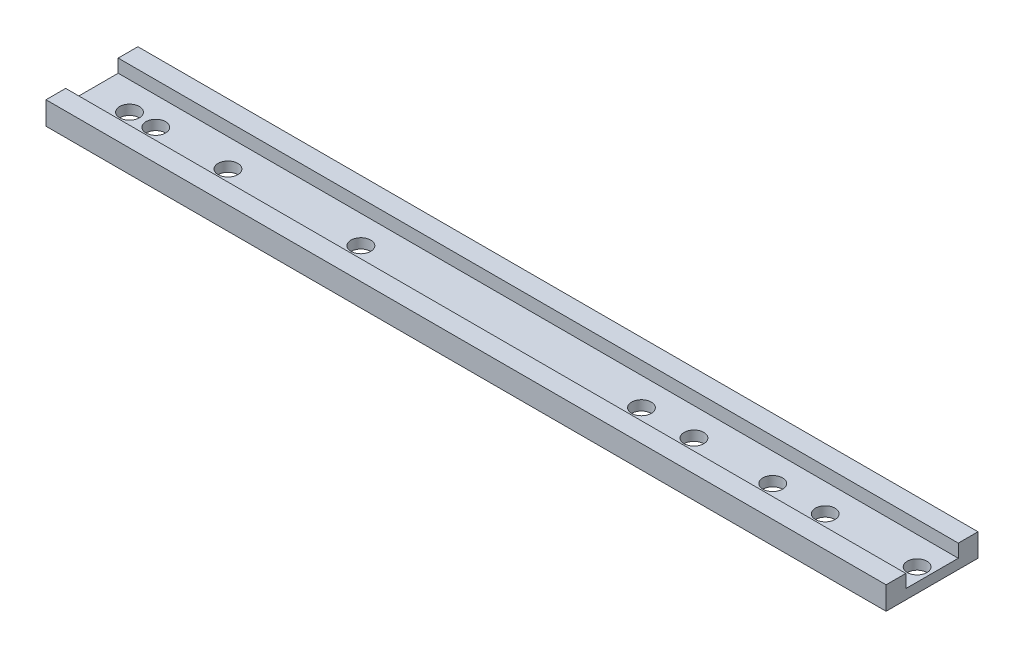
ISO-10303-21;
HEADER;
FILE_DESCRIPTION(('STEP AP214'),'2;1');
FILE_NAME('part.step','',(''),(''),'','','');
FILE_SCHEMA(('AUTOMOTIVE_DESIGN { 1 0 10303 214 1 1 1 1 }'));
ENDSEC;
DATA;
#1=APPLICATION_CONTEXT('core data for automotive mechanical design processes');
#2=APPLICATION_PROTOCOL_DEFINITION('international standard','automotive_design',2000,#1);
#3=PRODUCT_CONTEXT('',#1,'mechanical');
#4=PRODUCT('Part','Part','',(#3));
#5=PRODUCT_RELATED_PRODUCT_CATEGORY('part','',(#4));
#6=PRODUCT_DEFINITION_FORMATION('','',#4);
#7=PRODUCT_DEFINITION_CONTEXT('part definition',#1,'design');
#8=PRODUCT_DEFINITION('design','',#6,#7);
#9=PRODUCT_DEFINITION_SHAPE('','',#8);
#10=(LENGTH_UNIT() NAMED_UNIT(*) SI_UNIT(.MILLI.,.METRE.));
#11=(NAMED_UNIT(*) PLANE_ANGLE_UNIT() SI_UNIT($,.RADIAN.));
#12=(NAMED_UNIT(*) SI_UNIT($,.STERADIAN.) SOLID_ANGLE_UNIT());
#13=UNCERTAINTY_MEASURE_WITH_UNIT(LENGTH_MEASURE(1.E-05),#10,'distance_accuracy_value','');
#14=(GEOMETRIC_REPRESENTATION_CONTEXT(3) GLOBAL_UNCERTAINTY_ASSIGNED_CONTEXT((#13)) GLOBAL_UNIT_ASSIGNED_CONTEXT((#10,
#11,#12)) REPRESENTATION_CONTEXT('',''));
#15=CARTESIAN_POINT('',(0.,0.,0.));
#16=DIRECTION('',(0.,0.,1.));
#17=DIRECTION('',(1.,0.,0.));
#18=AXIS2_PLACEMENT_3D('',#15,#16,#17);
#19=CARTESIAN_POINT('',(211.2,6.88409090909091,11.825));
#20=DIRECTION('',(0.,-1.,0.));
#21=DIRECTION('',(0.,0.,-1.));
#22=AXIS2_PLACEMENT_3D('',#19,#20,#21);
#23=PLANE('',#22);
#24=DIRECTION('',(0.,0.,1.));
#25=VECTOR('',#24,1.);
#26=CARTESIAN_POINT('',(-195.2,6.88409090909091,11.825));
#27=LINE('',#26,#25);
#28=CARTESIAN_POINT('',(-195.2,6.88409090909091,11.825));
#29=VERTEX_POINT('',#28);
#30=CARTESIAN_POINT('',(-195.2,6.88409090909091,21.35));
#31=VERTEX_POINT('',#30);
#32=EDGE_CURVE('E132',#29,#31,#27,.T.);
#33=ORIENTED_EDGE('',*,*,#32,.T.);
#34=DIRECTION('',(-1.,0.,0.));
#35=VECTOR('',#34,1.);
#36=CARTESIAN_POINT('',(211.2,6.88409090909091,21.35));
#37=LINE('',#36,#35);
#38=CARTESIAN_POINT('',(211.2,6.88409090909091,21.35));
#39=VERTEX_POINT('',#38);
#40=EDGE_CURVE('E11',#39,#31,#37,.T.);
#41=ORIENTED_EDGE('',*,*,#40,.F.);
#42=DIRECTION('',(0.,0.,1.));
#43=VECTOR('',#42,1.);
#44=CARTESIAN_POINT('',(211.2,6.88409090909091,11.825));
#45=LINE('',#44,#43);
#46=CARTESIAN_POINT('',(211.2,6.88409090909091,11.825));
#47=VERTEX_POINT('',#46);
#48=EDGE_CURVE('E147',#47,#39,#45,.T.);
#49=ORIENTED_EDGE('',*,*,#48,.F.);
#50=DIRECTION('',(-1.,0.,0.));
#51=VECTOR('',#50,1.);
#52=CARTESIAN_POINT('',(211.2,6.88409090909091,11.825));
#53=LINE('',#52,#51);
#54=EDGE_CURVE('E128',#47,#29,#53,.T.);
#55=ORIENTED_EDGE('',*,*,#54,.T.);
#56=EDGE_LOOP('',(#33,#41,#49,#55));
#57=FACE_BOUND('',#56,.T.);
#58=ADVANCED_FACE('F34',(#57),#23,.F.);
#59=CARTESIAN_POINT('',(211.2,6.88409090909091,21.35));
#60=DIRECTION('',(0.,0.,-1.));
#61=DIRECTION('',(-1.,0.,0.));
#62=AXIS2_PLACEMENT_3D('',#59,#60,#61);
#63=PLANE('',#62);
#64=DIRECTION('',(0.,-1.,0.));
#65=VECTOR('',#64,1.);
#66=CARTESIAN_POINT('',(-195.2,6.88409090909091,21.35));
#67=LINE('',#66,#65);
#68=CARTESIAN_POINT('',(-195.2,-4.22840909090909,21.35));
#69=VERTEX_POINT('',#68);
#70=EDGE_CURVE('E135',#31,#69,#67,.T.);
#71=ORIENTED_EDGE('',*,*,#70,.T.);
#72=DIRECTION('',(-1.,0.,0.));
#73=VECTOR('',#72,1.);
#74=CARTESIAN_POINT('',(211.2,-4.22840909090909,21.35));
#75=LINE('',#74,#73);
#76=CARTESIAN_POINT('',(211.2,-4.22840909090909,21.35));
#77=VERTEX_POINT('',#76);
#78=EDGE_CURVE('E43',#77,#69,#75,.T.);
#79=ORIENTED_EDGE('',*,*,#78,.F.);
#80=DIRECTION('',(0.,-1.,0.));
#81=VECTOR('',#80,1.);
#82=CARTESIAN_POINT('',(211.2,6.88409090909091,21.35));
#83=LINE('',#82,#81);
#84=EDGE_CURVE('E95',#39,#77,#83,.T.);
#85=ORIENTED_EDGE('',*,*,#84,.F.);
#86=ORIENTED_EDGE('',*,*,#40,.T.);
#87=EDGE_LOOP('',(#71,#79,#85,#86));
#88=FACE_BOUND('',#87,.T.);
#89=ADVANCED_FACE('F246',(#88),#63,.F.);
#90=CARTESIAN_POINT('',(211.2,-4.22840909090909,21.35));
#91=DIRECTION('',(0.,1.,0.));
#92=DIRECTION('',(0.,0.,1.));
#93=AXIS2_PLACEMENT_3D('',#90,#91,#92);
#94=PLANE('',#93);
#95=CARTESIAN_POINT('',(204.85,-4.22840909090909,0.));
#96=DIRECTION('',(0.,-1.,0.));
#97=DIRECTION('',(0.,0.,-1.));
#98=AXIS2_PLACEMENT_3D('',#95,#96,#97);
#99=CIRCLE('',#98,4.76250000000001);
#100=CARTESIAN_POINT('',(204.85,-4.22840909090909,-4.76250000000001));
#101=VERTEX_POINT('',#100);
#102=EDGE_CURVE('E197',#101,#101,#99,.T.);
#103=ORIENTED_EDGE('',*,*,#102,.F.);
#104=EDGE_LOOP('',(#103));
#105=FACE_BOUND('',#104,.T.);
#106=CARTESIAN_POINT('',(160.4,-4.22840909090909,0.));
#107=DIRECTION('',(0.,-1.,0.));
#108=DIRECTION('',(0.,0.,-1.));
#109=AXIS2_PLACEMENT_3D('',#106,#107,#108);
#110=CIRCLE('',#109,4.76250000000001);
#111=CARTESIAN_POINT('',(160.4,-4.22840909090909,-4.76250000000001));
#112=VERTEX_POINT('',#111);
#113=EDGE_CURVE('E187',#112,#112,#110,.T.);
#114=ORIENTED_EDGE('',*,*,#113,.F.);
#115=EDGE_LOOP('',(#114));
#116=FACE_BOUND('',#115,.T.);
#117=CARTESIAN_POINT('',(135.,-4.22840909090909,0.));
#118=DIRECTION('',(0.,-1.,0.));
#119=DIRECTION('',(0.,0.,-1.));
#120=AXIS2_PLACEMENT_3D('',#117,#118,#119);
#121=CIRCLE('',#120,4.76250000000001);
#122=CARTESIAN_POINT('',(135.,-4.22840909090909,-4.76250000000001));
#123=VERTEX_POINT('',#122);
#124=EDGE_CURVE('E184',#123,#123,#121,.T.);
#125=ORIENTED_EDGE('',*,*,#124,.F.);
#126=EDGE_LOOP('',(#125));
#127=FACE_BOUND('',#126,.T.);
#128=CARTESIAN_POINT('',(96.9,-4.22840909090909,0.));
#129=DIRECTION('',(0.,-1.,0.));
#130=DIRECTION('',(0.,0.,-1.));
#131=AXIS2_PLACEMENT_3D('',#128,#129,#130);
#132=CIRCLE('',#131,4.7625);
#133=CARTESIAN_POINT('',(96.9,-4.22840909090909,-4.7625));
#134=VERTEX_POINT('',#133);
#135=EDGE_CURVE('E181',#134,#134,#132,.T.);
#136=ORIENTED_EDGE('',*,*,#135,.F.);
#137=EDGE_LOOP('',(#136));
#138=FACE_BOUND('',#137,.T.);
#139=CARTESIAN_POINT('',(71.5,-4.22840909090909,0.));
#140=DIRECTION('',(0.,-1.,0.));
#141=DIRECTION('',(0.,0.,-1.));
#142=AXIS2_PLACEMENT_3D('',#139,#140,#141);
#143=CIRCLE('',#142,4.7625);
#144=CARTESIAN_POINT('',(71.5,-4.22840909090909,-4.7625));
#145=VERTEX_POINT('',#144);
#146=EDGE_CURVE('E177',#145,#145,#143,.T.);
#147=ORIENTED_EDGE('',*,*,#146,.F.);
#148=EDGE_LOOP('',(#147));
#149=FACE_BOUND('',#148,.T.);
#150=CARTESIAN_POINT('',(-64.23125,-4.22840909090909,0.));
#151=DIRECTION('',(0.,-1.,0.));
#152=DIRECTION('',(0.,0.,-1.));
#153=AXIS2_PLACEMENT_3D('',#150,#151,#152);
#154=CIRCLE('',#153,4.7625);
#155=CARTESIAN_POINT('',(-64.23125,-4.22840909090909,-4.7625));
#156=VERTEX_POINT('',#155);
#157=EDGE_CURVE('E173',#156,#156,#154,.T.);
#158=ORIENTED_EDGE('',*,*,#157,.F.);
#159=EDGE_LOOP('',(#158));
#160=FACE_BOUND('',#159,.T.);
#161=CARTESIAN_POINT('',(-128.525,-4.22840909090909,0.));
#162=DIRECTION('',(0.,-1.,0.));
#163=DIRECTION('',(0.,0.,-1.));
#164=AXIS2_PLACEMENT_3D('',#161,#162,#163);
#165=CIRCLE('',#164,4.7625);
#166=CARTESIAN_POINT('',(-128.525,-4.22840909090909,-4.7625));
#167=VERTEX_POINT('',#166);
#168=EDGE_CURVE('E169',#167,#167,#165,.T.);
#169=ORIENTED_EDGE('',*,*,#168,.F.);
#170=EDGE_LOOP('',(#169));
#171=FACE_BOUND('',#170,.T.);
#172=CARTESIAN_POINT('',(-163.45,-4.22840909090909,0.));
#173=DIRECTION('',(0.,-1.,0.));
#174=DIRECTION('',(0.,0.,-1.));
#175=AXIS2_PLACEMENT_3D('',#172,#173,#174);
#176=CIRCLE('',#175,4.76250000000001);
#177=CARTESIAN_POINT('',(-163.45,-4.22840909090909,-4.76250000000001));
#178=VERTEX_POINT('',#177);
#179=EDGE_CURVE('E165',#178,#178,#176,.T.);
#180=ORIENTED_EDGE('',*,*,#179,.F.);
#181=EDGE_LOOP('',(#180));
#182=FACE_BOUND('',#181,.T.);
#183=CARTESIAN_POINT('',(-176.15,-4.22840909090909,0.));
#184=DIRECTION('',(0.,-1.,0.));
#185=DIRECTION('',(0.,0.,-1.));
#186=AXIS2_PLACEMENT_3D('',#183,#184,#185);
#187=CIRCLE('',#186,4.76250000000001);
#188=CARTESIAN_POINT('',(-176.15,-4.22840909090909,-4.76250000000001));
#189=VERTEX_POINT('',#188);
#190=EDGE_CURVE('E161',#189,#189,#187,.T.);
#191=ORIENTED_EDGE('',*,*,#190,.F.);
#192=EDGE_LOOP('',(#191));
#193=FACE_BOUND('',#192,.T.);
#194=DIRECTION('',(0.,0.,-1.));
#195=VECTOR('',#194,1.);
#196=CARTESIAN_POINT('',(-195.2,-4.22840909090909,21.35));
#197=LINE('',#196,#195);
#198=CARTESIAN_POINT('',(-195.2,-4.22840909090909,-23.1));
#199=VERTEX_POINT('',#198);
#200=EDGE_CURVE('E138',#69,#199,#197,.T.);
#201=ORIENTED_EDGE('',*,*,#200,.T.);
#202=DIRECTION('',(-1.,0.,0.));
#203=VECTOR('',#202,1.);
#204=CARTESIAN_POINT('',(211.2,-4.22840909090909,-23.1));
#205=LINE('',#204,#203);
#206=CARTESIAN_POINT('',(211.2,-4.22840909090909,-23.1));
#207=VERTEX_POINT('',#206);
#208=EDGE_CURVE('E154',#207,#199,#205,.T.);
#209=ORIENTED_EDGE('',*,*,#208,.F.);
#210=DIRECTION('',(0.,0.,-1.));
#211=VECTOR('',#210,1.);
#212=CARTESIAN_POINT('',(211.2,-4.22840909090909,21.35));
#213=LINE('',#212,#211);
#214=EDGE_CURVE('E214',#77,#207,#213,.T.);
#215=ORIENTED_EDGE('',*,*,#214,.F.);
#216=ORIENTED_EDGE('',*,*,#78,.T.);
#217=EDGE_LOOP('',(#201,#209,#215,#216));
#218=FACE_BOUND('',#217,.T.);
#219=ADVANCED_FACE('F250',(#105,#116,#127,#138,#149,#160,#171,#182,#193,#218),#94,.F.);
#220=CARTESIAN_POINT('',(211.2,-4.22840909090909,-23.1));
#221=DIRECTION('',(0.,0.,1.));
#222=DIRECTION('',(0.,-1.,0.));
#223=AXIS2_PLACEMENT_3D('',#220,#221,#222);
#224=PLANE('',#223);
#225=DIRECTION('',(0.,1.,0.));
#226=VECTOR('',#225,1.);
#227=CARTESIAN_POINT('',(-195.2,-4.22840909090909,-23.1));
#228=LINE('',#227,#226);
#229=CARTESIAN_POINT('',(-195.2,6.88409090909091,-23.1));
#230=VERTEX_POINT('',#229);
#231=EDGE_CURVE('E140',#199,#230,#228,.T.);
#232=ORIENTED_EDGE('',*,*,#231,.T.);
#233=DIRECTION('',(-1.,0.,0.));
#234=VECTOR('',#233,1.);
#235=CARTESIAN_POINT('',(211.2,6.88409090909091,-23.1));
#236=LINE('',#235,#234);
#237=CARTESIAN_POINT('',(211.2,6.88409090909091,-23.1));
#238=VERTEX_POINT('',#237);
#239=EDGE_CURVE('E151',#238,#230,#236,.T.);
#240=ORIENTED_EDGE('',*,*,#239,.F.);
#241=DIRECTION('',(0.,1.,0.));
#242=VECTOR('',#241,1.);
#243=CARTESIAN_POINT('',(211.2,-4.22840909090909,-23.1));
#244=LINE('',#243,#242);
#245=EDGE_CURVE('E216',#207,#238,#244,.T.);
#246=ORIENTED_EDGE('',*,*,#245,.F.);
#247=ORIENTED_EDGE('',*,*,#208,.T.);
#248=EDGE_LOOP('',(#232,#240,#246,#247));
#249=FACE_BOUND('',#248,.T.);
#250=ADVANCED_FACE('F222',(#249),#224,.F.);
#251=CARTESIAN_POINT('',(211.2,6.88409090909091,-23.1));
#252=DIRECTION('',(0.,-1.,0.));
#253=DIRECTION('',(0.,0.,-1.));
#254=AXIS2_PLACEMENT_3D('',#251,#252,#253);
#255=PLANE('',#254);
#256=DIRECTION('',(0.,0.,1.));
#257=VECTOR('',#256,1.);
#258=CARTESIAN_POINT('',(-195.2,6.88409090909091,-23.1));
#259=LINE('',#258,#257);
#260=CARTESIAN_POINT('',(-195.2,6.88409090909091,-13.575));
#261=VERTEX_POINT('',#260);
#262=EDGE_CURVE('E142',#230,#261,#259,.T.);
#263=ORIENTED_EDGE('',*,*,#262,.T.);
#264=DIRECTION('',(-1.,0.,0.));
#265=VECTOR('',#264,1.);
#266=CARTESIAN_POINT('',(211.2,6.88409090909091,-13.575));
#267=LINE('',#266,#265);
#268=CARTESIAN_POINT('',(211.2,6.88409090909091,-13.575));
#269=VERTEX_POINT('',#268);
#270=EDGE_CURVE('E123',#269,#261,#267,.T.);
#271=ORIENTED_EDGE('',*,*,#270,.F.);
#272=DIRECTION('',(0.,0.,1.));
#273=VECTOR('',#272,1.);
#274=CARTESIAN_POINT('',(211.2,6.88409090909091,-23.1));
#275=LINE('',#274,#273);
#276=EDGE_CURVE('E114',#238,#269,#275,.T.);
#277=ORIENTED_EDGE('',*,*,#276,.F.);
#278=ORIENTED_EDGE('',*,*,#239,.T.);
#279=EDGE_LOOP('',(#263,#271,#277,#278));
#280=FACE_BOUND('',#279,.T.);
#281=ADVANCED_FACE('F226',(#280),#255,.F.);
#282=CARTESIAN_POINT('',(211.2,6.88409090909091,-13.575));
#283=DIRECTION('',(0.,0.,-1.));
#284=DIRECTION('',(0.,1.,0.));
#285=AXIS2_PLACEMENT_3D('',#282,#283,#284);
#286=PLANE('',#285);
#287=DIRECTION('',(0.,-1.,0.));
#288=VECTOR('',#287,1.);
#289=CARTESIAN_POINT('',(-195.2,6.88409090909091,-13.575));
#290=LINE('',#289,#288);
#291=CARTESIAN_POINT('',(-195.2,0.534090909090912,-13.575));
#292=VERTEX_POINT('',#291);
#293=EDGE_CURVE('E122',#261,#292,#290,.T.);
#294=ORIENTED_EDGE('',*,*,#293,.T.);
#295=DIRECTION('',(-1.,0.,0.));
#296=VECTOR('',#295,1.);
#297=CARTESIAN_POINT('',(211.2,0.534090909090912,-13.575));
#298=LINE('',#297,#296);
#299=CARTESIAN_POINT('',(211.2,0.534090909090912,-13.575));
#300=VERTEX_POINT('',#299);
#301=EDGE_CURVE('E119',#300,#292,#298,.T.);
#302=ORIENTED_EDGE('',*,*,#301,.F.);
#303=DIRECTION('',(0.,-1.,0.));
#304=VECTOR('',#303,1.);
#305=CARTESIAN_POINT('',(211.2,6.88409090909091,-13.575));
#306=LINE('',#305,#304);
#307=EDGE_CURVE('E108',#269,#300,#306,.T.);
#308=ORIENTED_EDGE('',*,*,#307,.F.);
#309=ORIENTED_EDGE('',*,*,#270,.T.);
#310=EDGE_LOOP('',(#294,#302,#308,#309));
#311=FACE_BOUND('',#310,.T.);
#312=ADVANCED_FACE('F120',(#311),#286,.F.);
#313=CARTESIAN_POINT('',(211.2,0.534090909090912,-13.575));
#314=DIRECTION('',(0.,-1.,0.));
#315=DIRECTION('',(0.,0.,-1.));
#316=AXIS2_PLACEMENT_3D('',#313,#314,#315);
#317=PLANE('',#316);
#318=CARTESIAN_POINT('',(204.85,0.53409090909091,0.));
#319=DIRECTION('',(0.,-1.,0.));
#320=DIRECTION('',(0.,0.,-1.));
#321=AXIS2_PLACEMENT_3D('',#318,#319,#320);
#322=CIRCLE('',#321,4.76250000000001);
#323=CARTESIAN_POINT('',(204.85,0.534090909090911,-4.76250000000001));
#324=VERTEX_POINT('',#323);
#325=EDGE_CURVE('E37',#324,#324,#322,.T.);
#326=ORIENTED_EDGE('',*,*,#325,.T.);
#327=EDGE_LOOP('',(#326));
#328=FACE_BOUND('',#327,.T.);
#329=CARTESIAN_POINT('',(160.4,0.53409090909091,0.));
#330=DIRECTION('',(0.,-1.,0.));
#331=DIRECTION('',(0.,0.,-1.));
#332=AXIS2_PLACEMENT_3D('',#329,#330,#331);
#333=CIRCLE('',#332,4.76250000000001);
#334=CARTESIAN_POINT('',(160.4,0.534090909090911,-4.76250000000001));
#335=VERTEX_POINT('',#334);
#336=EDGE_CURVE('E185',#335,#335,#333,.T.);
#337=ORIENTED_EDGE('',*,*,#336,.T.);
#338=EDGE_LOOP('',(#337));
#339=FACE_BOUND('',#338,.T.);
#340=CARTESIAN_POINT('',(135.,0.53409090909091,0.));
#341=DIRECTION('',(0.,-1.,0.));
#342=DIRECTION('',(0.,0.,-1.));
#343=AXIS2_PLACEMENT_3D('',#340,#341,#342);
#344=CIRCLE('',#343,4.76250000000001);
#345=CARTESIAN_POINT('',(135.,0.534090909090911,-4.76250000000001));
#346=VERTEX_POINT('',#345);
#347=EDGE_CURVE('E182',#346,#346,#344,.T.);
#348=ORIENTED_EDGE('',*,*,#347,.T.);
#349=EDGE_LOOP('',(#348));
#350=FACE_BOUND('',#349,.T.);
#351=CARTESIAN_POINT('',(96.9,0.53409090909091,0.));
#352=DIRECTION('',(0.,-1.,0.));
#353=DIRECTION('',(0.,0.,-1.));
#354=AXIS2_PLACEMENT_3D('',#351,#352,#353);
#355=CIRCLE('',#354,4.7625);
#356=CARTESIAN_POINT('',(96.9,0.534090909090911,-4.7625));
#357=VERTEX_POINT('',#356);
#358=EDGE_CURVE('E178',#357,#357,#355,.T.);
#359=ORIENTED_EDGE('',*,*,#358,.T.);
#360=EDGE_LOOP('',(#359));
#361=FACE_BOUND('',#360,.T.);
#362=CARTESIAN_POINT('',(71.5,0.53409090909091,0.));
#363=DIRECTION('',(0.,-1.,0.));
#364=DIRECTION('',(0.,0.,-1.));
#365=AXIS2_PLACEMENT_3D('',#362,#363,#364);
#366=CIRCLE('',#365,4.7625);
#367=CARTESIAN_POINT('',(71.5,0.534090909090911,-4.7625));
#368=VERTEX_POINT('',#367);
#369=EDGE_CURVE('E174',#368,#368,#366,.T.);
#370=ORIENTED_EDGE('',*,*,#369,.T.);
#371=EDGE_LOOP('',(#370));
#372=FACE_BOUND('',#371,.T.);
#373=CARTESIAN_POINT('',(-64.23125,0.53409090909091,0.));
#374=DIRECTION('',(0.,-1.,0.));
#375=DIRECTION('',(0.,0.,-1.));
#376=AXIS2_PLACEMENT_3D('',#373,#374,#375);
#377=CIRCLE('',#376,4.7625);
#378=CARTESIAN_POINT('',(-64.23125,0.534090909090911,-4.7625));
#379=VERTEX_POINT('',#378);
#380=EDGE_CURVE('E170',#379,#379,#377,.T.);
#381=ORIENTED_EDGE('',*,*,#380,.T.);
#382=EDGE_LOOP('',(#381));
#383=FACE_BOUND('',#382,.T.);
#384=CARTESIAN_POINT('',(-128.525,0.53409090909091,0.));
#385=DIRECTION('',(0.,-1.,0.));
#386=DIRECTION('',(0.,0.,-1.));
#387=AXIS2_PLACEMENT_3D('',#384,#385,#386);
#388=CIRCLE('',#387,4.7625);
#389=CARTESIAN_POINT('',(-128.525,0.534090909090911,-4.7625));
#390=VERTEX_POINT('',#389);
#391=EDGE_CURVE('E166',#390,#390,#388,.T.);
#392=ORIENTED_EDGE('',*,*,#391,.T.);
#393=EDGE_LOOP('',(#392));
#394=FACE_BOUND('',#393,.T.);
#395=CARTESIAN_POINT('',(-163.45,0.53409090909091,0.));
#396=DIRECTION('',(0.,-1.,0.));
#397=DIRECTION('',(0.,0.,-1.));
#398=AXIS2_PLACEMENT_3D('',#395,#396,#397);
#399=CIRCLE('',#398,4.76250000000001);
#400=CARTESIAN_POINT('',(-163.45,0.534090909090911,-4.76250000000001));
#401=VERTEX_POINT('',#400);
#402=EDGE_CURVE('E162',#401,#401,#399,.T.);
#403=ORIENTED_EDGE('',*,*,#402,.T.);
#404=EDGE_LOOP('',(#403));
#405=FACE_BOUND('',#404,.T.);
#406=CARTESIAN_POINT('',(-176.15,0.53409090909091,0.));
#407=DIRECTION('',(0.,-1.,0.));
#408=DIRECTION('',(0.,0.,-1.));
#409=AXIS2_PLACEMENT_3D('',#406,#407,#408);
#410=CIRCLE('',#409,4.76250000000001);
#411=CARTESIAN_POINT('',(-176.15,0.534090909090911,-4.76250000000001));
#412=VERTEX_POINT('',#411);
#413=EDGE_CURVE('E136',#412,#412,#410,.T.);
#414=ORIENTED_EDGE('',*,*,#413,.T.);
#415=EDGE_LOOP('',(#414));
#416=FACE_BOUND('',#415,.T.);
#417=DIRECTION('',(0.,0.,1.));
#418=VECTOR('',#417,1.);
#419=CARTESIAN_POINT('',(-195.2,0.534090909090912,-13.575));
#420=LINE('',#419,#418);
#421=CARTESIAN_POINT('',(-195.2,0.534090909090908,11.825));
#422=VERTEX_POINT('',#421);
#423=EDGE_CURVE('E81',#292,#422,#420,.T.);
#424=ORIENTED_EDGE('',*,*,#423,.T.);
#425=DIRECTION('',(-1.,0.,0.));
#426=VECTOR('',#425,1.);
#427=CARTESIAN_POINT('',(211.2,0.534090909090908,11.825));
#428=LINE('',#427,#426);
#429=CARTESIAN_POINT('',(211.2,0.534090909090908,11.825));
#430=VERTEX_POINT('',#429);
#431=EDGE_CURVE('E124',#430,#422,#428,.T.);
#432=ORIENTED_EDGE('',*,*,#431,.F.);
#433=DIRECTION('',(0.,0.,1.));
#434=VECTOR('',#433,1.);
#435=CARTESIAN_POINT('',(211.2,0.534090909090912,-13.575));
#436=LINE('',#435,#434);
#437=EDGE_CURVE('E112',#300,#430,#436,.T.);
#438=ORIENTED_EDGE('',*,*,#437,.F.);
#439=ORIENTED_EDGE('',*,*,#301,.T.);
#440=EDGE_LOOP('',(#424,#432,#438,#439));
#441=FACE_BOUND('',#440,.T.);
#442=ADVANCED_FACE('F126',(#328,#339,#350,#361,#372,#383,#394,#405,#416,#441),#317,.F.);
#443=CARTESIAN_POINT('',(211.2,0.534090909090908,11.825));
#444=DIRECTION('',(0.,0.,1.));
#445=DIRECTION('',(0.,-1.,0.));
#446=AXIS2_PLACEMENT_3D('',#443,#444,#445);
#447=PLANE('',#446);
#448=DIRECTION('',(0.,1.,0.));
#449=VECTOR('',#448,1.);
#450=CARTESIAN_POINT('',(-195.2,0.534090909090908,11.825));
#451=LINE('',#450,#449);
#452=EDGE_CURVE('E87',#422,#29,#451,.T.);
#453=ORIENTED_EDGE('',*,*,#452,.T.);
#454=ORIENTED_EDGE('',*,*,#54,.F.);
#455=DIRECTION('',(0.,1.,0.));
#456=VECTOR('',#455,1.);
#457=CARTESIAN_POINT('',(211.2,0.534090909090908,11.825));
#458=LINE('',#457,#456);
#459=EDGE_CURVE('E52',#430,#47,#458,.T.);
#460=ORIENTED_EDGE('',*,*,#459,.F.);
#461=ORIENTED_EDGE('',*,*,#431,.T.);
#462=EDGE_LOOP('',(#453,#454,#460,#461));
#463=FACE_BOUND('',#462,.T.);
#464=ADVANCED_FACE('F234',(#463),#447,.F.);
#465=CARTESIAN_POINT('',(211.2,-4.22840909090909,21.35));
#466=DIRECTION('',(1.,0.,0.));
#467=DIRECTION('',(0.,0.,-1.));
#468=AXIS2_PLACEMENT_3D('',#465,#466,#467);
#469=PLANE('',#468);
#470=ORIENTED_EDGE('',*,*,#48,.T.);
#471=ORIENTED_EDGE('',*,*,#84,.T.);
#472=ORIENTED_EDGE('',*,*,#214,.T.);
#473=ORIENTED_EDGE('',*,*,#245,.T.);
#474=ORIENTED_EDGE('',*,*,#276,.T.);
#475=ORIENTED_EDGE('',*,*,#307,.T.);
#476=ORIENTED_EDGE('',*,*,#437,.T.);
#477=ORIENTED_EDGE('',*,*,#459,.T.);
#478=EDGE_LOOP('',(#470,#471,#472,#473,#474,#475,#476,#477));
#479=FACE_BOUND('',#478,.T.);
#480=ADVANCED_FACE('F110',(#479),#469,.T.);
#481=CARTESIAN_POINT('',(-195.2,-4.22840909090909,21.35));
#482=DIRECTION('',(1.,0.,0.));
#483=DIRECTION('',(0.,0.,-1.));
#484=AXIS2_PLACEMENT_3D('',#481,#482,#483);
#485=PLANE('',#484);
#486=ORIENTED_EDGE('',*,*,#32,.F.);
#487=ORIENTED_EDGE('',*,*,#452,.F.);
#488=ORIENTED_EDGE('',*,*,#423,.F.);
#489=ORIENTED_EDGE('',*,*,#293,.F.);
#490=ORIENTED_EDGE('',*,*,#262,.F.);
#491=ORIENTED_EDGE('',*,*,#231,.F.);
#492=ORIENTED_EDGE('',*,*,#200,.F.);
#493=ORIENTED_EDGE('',*,*,#70,.F.);
#494=EDGE_LOOP('',(#486,#487,#488,#489,#490,#491,#492,#493));
#495=FACE_BOUND('',#494,.T.);
#496=ADVANCED_FACE('F229',(#495),#485,.F.);
#497=CARTESIAN_POINT('',(-176.15,6.88409090909091,0.));
#498=DIRECTION('',(0.,-1.,0.));
#499=DIRECTION('',(0.,0.,-1.));
#500=AXIS2_PLACEMENT_3D('',#497,#498,#499);
#501=CYLINDRICAL_SURFACE('',#500,4.76250000000001);
#502=ORIENTED_EDGE('',*,*,#190,.T.);
#503=EDGE_LOOP('',(#502));
#504=FACE_BOUND('',#503,.T.);
#505=ORIENTED_EDGE('',*,*,#413,.F.);
#506=EDGE_LOOP('',(#505));
#507=FACE_BOUND('',#506,.T.);
#508=ADVANCED_FACE('F280',(#504,#507),#501,.F.);
#509=CARTESIAN_POINT('',(-163.45,6.88409090909091,0.));
#510=DIRECTION('',(0.,-1.,0.));
#511=DIRECTION('',(0.,0.,-1.));
#512=AXIS2_PLACEMENT_3D('',#509,#510,#511);
#513=CYLINDRICAL_SURFACE('',#512,4.76250000000001);
#514=ORIENTED_EDGE('',*,*,#179,.T.);
#515=EDGE_LOOP('',(#514));
#516=FACE_BOUND('',#515,.T.);
#517=ORIENTED_EDGE('',*,*,#402,.F.);
#518=EDGE_LOOP('',(#517));
#519=FACE_BOUND('',#518,.T.);
#520=ADVANCED_FACE('F285',(#516,#519),#513,.F.);
#521=CARTESIAN_POINT('',(-128.525,6.88409090909091,0.));
#522=DIRECTION('',(0.,-1.,0.));
#523=DIRECTION('',(0.,0.,-1.));
#524=AXIS2_PLACEMENT_3D('',#521,#522,#523);
#525=CYLINDRICAL_SURFACE('',#524,4.7625);
#526=ORIENTED_EDGE('',*,*,#168,.T.);
#527=EDGE_LOOP('',(#526));
#528=FACE_BOUND('',#527,.T.);
#529=ORIENTED_EDGE('',*,*,#391,.F.);
#530=EDGE_LOOP('',(#529));
#531=FACE_BOUND('',#530,.T.);
#532=ADVANCED_FACE('F297',(#528,#531),#525,.F.);
#533=CARTESIAN_POINT('',(-64.23125,6.88409090909091,0.));
#534=DIRECTION('',(0.,-1.,0.));
#535=DIRECTION('',(0.,0.,-1.));
#536=AXIS2_PLACEMENT_3D('',#533,#534,#535);
#537=CYLINDRICAL_SURFACE('',#536,4.7625);
#538=ORIENTED_EDGE('',*,*,#157,.T.);
#539=EDGE_LOOP('',(#538));
#540=FACE_BOUND('',#539,.T.);
#541=ORIENTED_EDGE('',*,*,#380,.F.);
#542=EDGE_LOOP('',(#541));
#543=FACE_BOUND('',#542,.T.);
#544=ADVANCED_FACE('F307',(#540,#543),#537,.F.);
#545=CARTESIAN_POINT('',(71.5,6.88409090909091,0.));
#546=DIRECTION('',(0.,-1.,0.));
#547=DIRECTION('',(0.,0.,-1.));
#548=AXIS2_PLACEMENT_3D('',#545,#546,#547);
#549=CYLINDRICAL_SURFACE('',#548,4.7625);
#550=ORIENTED_EDGE('',*,*,#146,.T.);
#551=EDGE_LOOP('',(#550));
#552=FACE_BOUND('',#551,.T.);
#553=ORIENTED_EDGE('',*,*,#369,.F.);
#554=EDGE_LOOP('',(#553));
#555=FACE_BOUND('',#554,.T.);
#556=ADVANCED_FACE('F317',(#552,#555),#549,.F.);
#557=CARTESIAN_POINT('',(96.9,6.88409090909091,0.));
#558=DIRECTION('',(0.,-1.,0.));
#559=DIRECTION('',(0.,0.,-1.));
#560=AXIS2_PLACEMENT_3D('',#557,#558,#559);
#561=CYLINDRICAL_SURFACE('',#560,4.7625);
#562=ORIENTED_EDGE('',*,*,#135,.T.);
#563=EDGE_LOOP('',(#562));
#564=FACE_BOUND('',#563,.T.);
#565=ORIENTED_EDGE('',*,*,#358,.F.);
#566=EDGE_LOOP('',(#565));
#567=FACE_BOUND('',#566,.T.);
#568=ADVANCED_FACE('F327',(#564,#567),#561,.F.);
#569=CARTESIAN_POINT('',(135.,6.88409090909091,0.));
#570=DIRECTION('',(0.,-1.,0.));
#571=DIRECTION('',(0.,0.,-1.));
#572=AXIS2_PLACEMENT_3D('',#569,#570,#571);
#573=CYLINDRICAL_SURFACE('',#572,4.76250000000001);
#574=ORIENTED_EDGE('',*,*,#124,.T.);
#575=EDGE_LOOP('',(#574));
#576=FACE_BOUND('',#575,.T.);
#577=ORIENTED_EDGE('',*,*,#347,.F.);
#578=EDGE_LOOP('',(#577));
#579=FACE_BOUND('',#578,.T.);
#580=ADVANCED_FACE('F337',(#576,#579),#573,.F.);
#581=CARTESIAN_POINT('',(160.4,6.88409090909091,0.));
#582=DIRECTION('',(0.,-1.,0.));
#583=DIRECTION('',(0.,0.,-1.));
#584=AXIS2_PLACEMENT_3D('',#581,#582,#583);
#585=CYLINDRICAL_SURFACE('',#584,4.76250000000001);
#586=ORIENTED_EDGE('',*,*,#113,.T.);
#587=EDGE_LOOP('',(#586));
#588=FACE_BOUND('',#587,.T.);
#589=ORIENTED_EDGE('',*,*,#336,.F.);
#590=EDGE_LOOP('',(#589));
#591=FACE_BOUND('',#590,.T.);
#592=ADVANCED_FACE('F347',(#588,#591),#585,.F.);
#593=CARTESIAN_POINT('',(204.85,6.88409090909091,0.));
#594=DIRECTION('',(0.,-1.,0.));
#595=DIRECTION('',(0.,0.,-1.));
#596=AXIS2_PLACEMENT_3D('',#593,#594,#595);
#597=CYLINDRICAL_SURFACE('',#596,4.76250000000001);
#598=ORIENTED_EDGE('',*,*,#102,.T.);
#599=EDGE_LOOP('',(#598));
#600=FACE_BOUND('',#599,.T.);
#601=ORIENTED_EDGE('',*,*,#325,.F.);
#602=EDGE_LOOP('',(#601));
#603=FACE_BOUND('',#602,.T.);
#604=ADVANCED_FACE('F357',(#600,#603),#597,.F.);
#605=CLOSED_SHELL('',(#58,#89,#219,#250,#281,#312,#442,#464,#480,#496,#508,#520,#532,#544,#556,
#568,#580,#592,#604));
#606=MANIFOLD_SOLID_BREP('B2',#605);
#607=ADVANCED_BREP_SHAPE_REPRESENTATION('',(#18,#606),#14);
#608=SHAPE_DEFINITION_REPRESENTATION(#9,#607);
ENDSEC;
END-ISO-10303-21;
